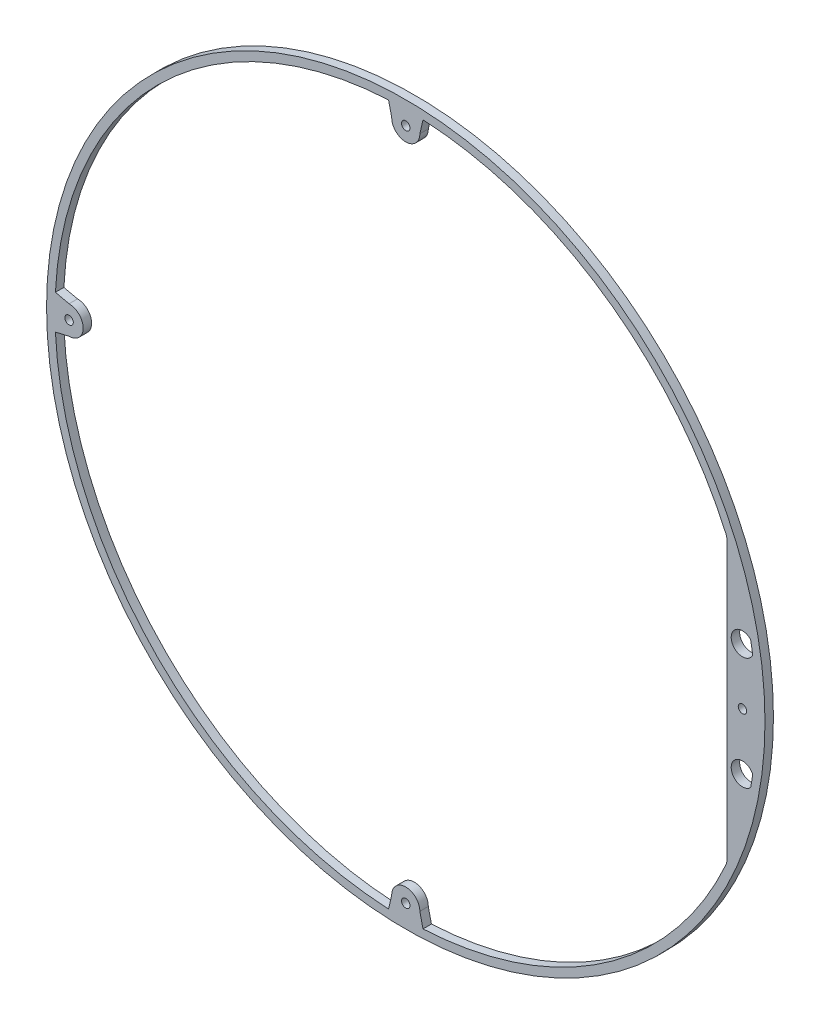
ISO-10303-21;
HEADER;
FILE_DESCRIPTION(('STEP AP214'),'2;1');
FILE_NAME('part.step','',(''),(''),'','','');
FILE_SCHEMA(('AUTOMOTIVE_DESIGN { 1 0 10303 214 1 1 1 1 }'));
ENDSEC;
DATA;
#1=APPLICATION_CONTEXT('core data for automotive mechanical design processes');
#2=APPLICATION_PROTOCOL_DEFINITION('international standard','automotive_design',2000,#1);
#3=PRODUCT_CONTEXT('',#1,'mechanical');
#4=PRODUCT('Part','Part','',(#3));
#5=PRODUCT_RELATED_PRODUCT_CATEGORY('part','',(#4));
#6=PRODUCT_DEFINITION_FORMATION('','',#4);
#7=PRODUCT_DEFINITION_CONTEXT('part definition',#1,'design');
#8=PRODUCT_DEFINITION('design','',#6,#7);
#9=PRODUCT_DEFINITION_SHAPE('','',#8);
#10=(LENGTH_UNIT() NAMED_UNIT(*) SI_UNIT(.MILLI.,.METRE.));
#11=(NAMED_UNIT(*) PLANE_ANGLE_UNIT() SI_UNIT($,.RADIAN.));
#12=(NAMED_UNIT(*) SI_UNIT($,.STERADIAN.) SOLID_ANGLE_UNIT());
#13=UNCERTAINTY_MEASURE_WITH_UNIT(LENGTH_MEASURE(1.E-05),#10,'distance_accuracy_value','');
#14=(GEOMETRIC_REPRESENTATION_CONTEXT(3) GLOBAL_UNCERTAINTY_ASSIGNED_CONTEXT((#13)) GLOBAL_UNIT_ASSIGNED_CONTEXT((#10,
#11,#12)) REPRESENTATION_CONTEXT('',''));
#15=CARTESIAN_POINT('',(0.,0.,0.));
#16=DIRECTION('',(0.,0.,1.));
#17=DIRECTION('',(1.,0.,0.));
#18=AXIS2_PLACEMENT_3D('',#15,#16,#17);
#19=CARTESIAN_POINT('',(0.,0.,3.));
#20=DIRECTION('',(0.,0.,-1.));
#21=DIRECTION('',(-1.,0.,0.));
#22=AXIS2_PLACEMENT_3D('',#19,#20,#21);
#23=CYLINDRICAL_SURFACE('',#22,124.525);
#24=CARTESIAN_POINT('',(0.,0.,0.));
#25=DIRECTION('',(0.,0.,1.));
#26=DIRECTION('',(1.,0.,0.));
#27=AXIS2_PLACEMENT_3D('',#24,#25,#26);
#28=CIRCLE('',#27,124.525);
#29=CARTESIAN_POINT('',(122.429089665661,-22.7506841355913,0.));
#30=VERTEX_POINT('',#29);
#31=CARTESIAN_POINT('',(123.166362086514,-18.3445598304702,0.));
#32=VERTEX_POINT('',#31);
#33=EDGE_CURVE('E355',#30,#32,#28,.T.);
#34=ORIENTED_EDGE('',*,*,#33,.F.);
#35=DIRECTION('',(0.,0.,1.));
#36=VECTOR('',#35,1.);
#37=CARTESIAN_POINT('',(122.429089665661,-22.7506841355913,-100.532032474409));
#38=LINE('',#37,#36);
#39=CARTESIAN_POINT('',(122.429089665661,-22.7506841355913,3.));
#40=VERTEX_POINT('',#39);
#41=EDGE_CURVE('E206',#30,#40,#38,.T.);
#42=ORIENTED_EDGE('',*,*,#41,.T.);
#43=CARTESIAN_POINT('',(0.,0.,3.));
#44=DIRECTION('',(0.,0.,1.));
#45=DIRECTION('',(1.,0.,0.));
#46=AXIS2_PLACEMENT_3D('',#43,#44,#45);
#47=CIRCLE('',#46,124.525);
#48=CARTESIAN_POINT('',(123.166362086514,-18.3445598304702,3.));
#49=VERTEX_POINT('',#48);
#50=EDGE_CURVE('E202',#40,#49,#47,.T.);
#51=ORIENTED_EDGE('',*,*,#50,.T.);
#52=DIRECTION('',(0.,0.,1.));
#53=VECTOR('',#52,1.);
#54=CARTESIAN_POINT('',(123.166362086514,-18.3445598304702,-100.532032474409));
#55=LINE('',#54,#53);
#56=EDGE_CURVE('E183',#32,#49,#55,.T.);
#57=ORIENTED_EDGE('',*,*,#56,.F.);
#58=EDGE_LOOP('',(#34,#42,#51,#57));
#59=FACE_BOUND('',#58,.T.);
#60=ADVANCED_FACE('F47',(#59),#23,.F.);
#61=CARTESIAN_POINT('',(6.11023731126729,-124.375,3.));
#62=VERTEX_POINT('',#61);
#63=CARTESIAN_POINT('',(113.607573635243,-50.9881833144974,3.));
#64=VERTEX_POINT('',#63);
#65=EDGE_CURVE('E208',#62,#64,#47,.T.);
#66=ORIENTED_EDGE('',*,*,#65,.T.);
#67=DIRECTION('',(0.,0.,-1.));
#68=VECTOR('',#67,1.);
#69=CARTESIAN_POINT('',(113.607573635243,-50.9881833144974,3.));
#70=LINE('',#69,#68);
#71=CARTESIAN_POINT('',(113.607573635243,-50.9881833144974,0.));
#72=VERTEX_POINT('',#71);
#73=EDGE_CURVE('E440',#64,#72,#70,.T.);
#74=ORIENTED_EDGE('',*,*,#73,.T.);
#75=CARTESIAN_POINT('',(6.11023731126729,-124.375,0.));
#76=VERTEX_POINT('',#75);
#77=EDGE_CURVE('E221',#76,#72,#28,.T.);
#78=ORIENTED_EDGE('',*,*,#77,.F.);
#79=DIRECTION('',(0.,0.,1.));
#80=VECTOR('',#79,1.);
#81=CARTESIAN_POINT('',(6.11023731126729,-124.375,-15.7905034751908));
#82=LINE('',#81,#80);
#83=EDGE_CURVE('E273',#76,#62,#82,.T.);
#84=ORIENTED_EDGE('',*,*,#83,.T.);
#85=EDGE_LOOP('',(#66,#74,#78,#84));
#86=FACE_BOUND('',#85,.T.);
#87=ADVANCED_FACE('F504',(#86),#23,.F.);
#88=CARTESIAN_POINT('',(123.166362086514,18.3445598304702,0.));
#89=VERTEX_POINT('',#88);
#90=CARTESIAN_POINT('',(122.429089665662,22.7506841355918,0.));
#91=VERTEX_POINT('',#90);
#92=EDGE_CURVE('E209',#89,#91,#28,.T.);
#93=ORIENTED_EDGE('',*,*,#92,.F.);
#94=DIRECTION('',(0.,0.,1.));
#95=VECTOR('',#94,1.);
#96=CARTESIAN_POINT('',(123.166362086514,18.3445598304702,-100.532032474409));
#97=LINE('',#96,#95);
#98=CARTESIAN_POINT('',(123.166362086514,18.3445598304702,3.));
#99=VERTEX_POINT('',#98);
#100=EDGE_CURVE('E195',#89,#99,#97,.T.);
#101=ORIENTED_EDGE('',*,*,#100,.T.);
#102=CARTESIAN_POINT('',(122.429089665661,22.7506841355914,3.));
#103=VERTEX_POINT('',#102);
#104=EDGE_CURVE('E217',#99,#103,#47,.T.);
#105=ORIENTED_EDGE('',*,*,#104,.T.);
#106=DIRECTION('',(0.,0.,1.));
#107=VECTOR('',#106,1.);
#108=CARTESIAN_POINT('',(122.429089665661,22.7506841355914,-100.532032474409));
#109=LINE('',#108,#107);
#110=EDGE_CURVE('E322',#91,#103,#109,.T.);
#111=ORIENTED_EDGE('',*,*,#110,.F.);
#112=EDGE_LOOP('',(#93,#101,#105,#111));
#113=FACE_BOUND('',#112,.T.);
#114=ADVANCED_FACE('F510',(#113),#23,.F.);
#115=CARTESIAN_POINT('',(-6.11023731126728,124.375,0.));
#116=VERTEX_POINT('',#115);
#117=CARTESIAN_POINT('',(-124.375,6.11023731126726,0.));
#118=VERTEX_POINT('',#117);
#119=EDGE_CURVE('E418',#116,#118,#28,.T.);
#120=ORIENTED_EDGE('',*,*,#119,.F.);
#121=DIRECTION('',(0.,0.,1.));
#122=VECTOR('',#121,1.);
#123=CARTESIAN_POINT('',(-6.11023731126728,124.375,-15.7905034751908));
#124=LINE('',#123,#122);
#125=CARTESIAN_POINT('',(-6.11023731126728,124.375,3.));
#126=VERTEX_POINT('',#125);
#127=EDGE_CURVE('E341',#116,#126,#124,.T.);
#128=ORIENTED_EDGE('',*,*,#127,.T.);
#129=CARTESIAN_POINT('',(-124.375,6.11023731126726,3.));
#130=VERTEX_POINT('',#129);
#131=EDGE_CURVE('E212',#126,#130,#47,.T.);
#132=ORIENTED_EDGE('',*,*,#131,.T.);
#133=DIRECTION('',(0.,0.,1.));
#134=VECTOR('',#133,1.);
#135=CARTESIAN_POINT('',(-124.375,6.11023731126726,-15.7905034751908));
#136=LINE('',#135,#134);
#137=EDGE_CURVE('E391',#118,#130,#136,.T.);
#138=ORIENTED_EDGE('',*,*,#137,.F.);
#139=EDGE_LOOP('',(#120,#128,#132,#138));
#140=FACE_BOUND('',#139,.T.);
#141=ADVANCED_FACE('F417',(#140),#23,.F.);
#142=CARTESIAN_POINT('',(-124.375,-6.1102373112673,0.));
#143=VERTEX_POINT('',#142);
#144=CARTESIAN_POINT('',(-6.11023731126726,-124.375,0.));
#145=VERTEX_POINT('',#144);
#146=EDGE_CURVE('E424',#143,#145,#28,.T.);
#147=ORIENTED_EDGE('',*,*,#146,.F.);
#148=DIRECTION('',(0.,0.,1.));
#149=VECTOR('',#148,1.);
#150=CARTESIAN_POINT('',(-124.375,-6.1102373112673,-15.7905034751908));
#151=LINE('',#150,#149);
#152=CARTESIAN_POINT('',(-124.375,-6.1102373112673,3.));
#153=VERTEX_POINT('',#152);
#154=EDGE_CURVE('E240',#143,#153,#151,.T.);
#155=ORIENTED_EDGE('',*,*,#154,.T.);
#156=CARTESIAN_POINT('',(-6.11023731126726,-124.375,3.));
#157=VERTEX_POINT('',#156);
#158=EDGE_CURVE('E216',#153,#157,#47,.T.);
#159=ORIENTED_EDGE('',*,*,#158,.T.);
#160=DIRECTION('',(0.,0.,1.));
#161=VECTOR('',#160,1.);
#162=CARTESIAN_POINT('',(-6.11023731126726,-124.375,-15.7905034751908));
#163=LINE('',#162,#161);
#164=EDGE_CURVE('E238',#145,#157,#163,.T.);
#165=ORIENTED_EDGE('',*,*,#164,.F.);
#166=EDGE_LOOP('',(#147,#155,#159,#165));
#167=FACE_BOUND('',#166,.T.);
#168=ADVANCED_FACE('F237',(#167),#23,.F.);
#169=CARTESIAN_POINT('',(113.607573635243,50.9881833144974,0.));
#170=VERTEX_POINT('',#169);
#171=CARTESIAN_POINT('',(6.11023731126729,124.375,0.));
#172=VERTEX_POINT('',#171);
#173=EDGE_CURVE('E219',#170,#172,#28,.T.);
#174=ORIENTED_EDGE('',*,*,#173,.F.);
#175=DIRECTION('',(0.,0.,-1.));
#176=VECTOR('',#175,1.);
#177=CARTESIAN_POINT('',(113.607573635243,50.9881833144974,3.));
#178=LINE('',#177,#176);
#179=CARTESIAN_POINT('',(113.607573635243,50.9881833144974,3.));
#180=VERTEX_POINT('',#179);
#181=EDGE_CURVE('E448',#170,#180,#178,.F.);
#182=ORIENTED_EDGE('',*,*,#181,.T.);
#183=CARTESIAN_POINT('',(6.11023731126728,124.375,3.));
#184=VERTEX_POINT('',#183);
#185=EDGE_CURVE('E211',#180,#184,#47,.T.);
#186=ORIENTED_EDGE('',*,*,#185,.T.);
#187=DIRECTION('',(0.,0.,1.));
#188=VECTOR('',#187,1.);
#189=CARTESIAN_POINT('',(6.11023731126728,124.375,-15.7905034751908));
#190=LINE('',#189,#188);
#191=EDGE_CURVE('E351',#172,#184,#190,.T.);
#192=ORIENTED_EDGE('',*,*,#191,.F.);
#193=EDGE_LOOP('',(#174,#182,#186,#192));
#194=FACE_BOUND('',#193,.T.);
#195=ADVANCED_FACE('F496',(#194),#23,.F.);
#196=CARTESIAN_POINT('',(0.,0.,3.));
#197=DIRECTION('',(0.,0.,1.));
#198=DIRECTION('',(1.,0.,0.));
#199=AXIS2_PLACEMENT_3D('',#196,#197,#198);
#200=PLANE('',#199);
#201=CARTESIAN_POINT('',(119.525,-20.,3.));
#202=DIRECTION('',(0.,0.,1.));
#203=DIRECTION('',(1.,0.,0.));
#204=AXIS2_PLACEMENT_3D('',#201,#202,#203);
#205=CIRCLE('',#204,3.99999999999999);
#206=EDGE_CURVE('E186',#49,#40,#205,.T.);
#207=ORIENTED_EDGE('',*,*,#206,.F.);
#208=ORIENTED_EDGE('',*,*,#50,.F.);
#209=EDGE_LOOP('',(#207,#208));
#210=FACE_BOUND('',#209,.T.);
#211=ORIENTED_EDGE('',*,*,#104,.F.);
#212=CARTESIAN_POINT('',(119.525,20.,3.));
#213=DIRECTION('',(0.,0.,1.));
#214=DIRECTION('',(1.,0.,0.));
#215=AXIS2_PLACEMENT_3D('',#212,#213,#214);
#216=CIRCLE('',#215,3.99999999999999);
#217=EDGE_CURVE('E204',#103,#99,#216,.T.);
#218=ORIENTED_EDGE('',*,*,#217,.F.);
#219=EDGE_LOOP('',(#211,#218));
#220=FACE_BOUND('',#219,.T.);
#221=ORIENTED_EDGE('',*,*,#185,.F.);
#222=CARTESIAN_POINT('',(109.0459364686,48.9408762149392,3.));
#223=DIRECTION('',(0.,0.,1.));
#224=DIRECTION('',(1.,0.,0.));
#225=AXIS2_PLACEMENT_3D('',#222,#223,#224);
#226=CIRCLE('',#225,5.);
#227=CARTESIAN_POINT('',(114.0459364686,48.9408762149392,3.));
#228=VERTEX_POINT('',#227);
#229=EDGE_CURVE('E56',#180,#228,#226,.F.);
#230=ORIENTED_EDGE('',*,*,#229,.T.);
#231=DIRECTION('',(0.,-1.,0.));
#232=VECTOR('',#231,1.);
#233=CARTESIAN_POINT('',(114.0459364686,0.,3.));
#234=LINE('',#233,#232);
#235=CARTESIAN_POINT('',(114.0459364686,-48.9408762149392,3.));
#236=VERTEX_POINT('',#235);
#237=EDGE_CURVE('E196',#228,#236,#234,.T.);
#238=ORIENTED_EDGE('',*,*,#237,.T.);
#239=CARTESIAN_POINT('',(109.0459364686,-48.9408762149392,3.));
#240=DIRECTION('',(0.,0.,1.));
#241=DIRECTION('',(1.,0.,0.));
#242=AXIS2_PLACEMENT_3D('',#239,#240,#241);
#243=CIRCLE('',#242,5.);
#244=EDGE_CURVE('E444',#236,#64,#243,.F.);
#245=ORIENTED_EDGE('',*,*,#244,.T.);
#246=ORIENTED_EDGE('',*,*,#65,.F.);
#247=DIRECTION('',(0.223142985847924,-0.974785724078309,0.));
#248=VECTOR('',#247,1.);
#249=CARTESIAN_POINT('',(-21.2476352210068,-4.86390049454815,3.));
#250=LINE('',#249,#248);
#251=CARTESIAN_POINT('',(5.00000000000002,-119.525,3.));
#252=VERTEX_POINT('',#251);
#253=EDGE_CURVE('E270',#252,#62,#250,.T.);
#254=ORIENTED_EDGE('',*,*,#253,.F.);
#255=CARTESIAN_POINT('',(0.,-119.525,3.));
#256=DIRECTION('',(0.,0.,1.));
#257=DIRECTION('',(1.,0.,0.));
#258=AXIS2_PLACEMENT_3D('',#255,#256,#257);
#259=CIRCLE('',#258,5.);
#260=CARTESIAN_POINT('',(-4.99999999999998,-119.525,3.));
#261=VERTEX_POINT('',#260);
#262=EDGE_CURVE('E254',#252,#261,#259,.T.);
#263=ORIENTED_EDGE('',*,*,#262,.T.);
#264=DIRECTION('',(-0.223142985847924,-0.974785724078309,0.));
#265=VECTOR('',#264,1.);
#266=CARTESIAN_POINT('',(21.2476352210068,-4.86390049454815,3.));
#267=LINE('',#266,#265);
#268=EDGE_CURVE('E251',#261,#157,#267,.T.);
#269=ORIENTED_EDGE('',*,*,#268,.T.);
#270=ORIENTED_EDGE('',*,*,#158,.F.);
#271=DIRECTION('',(-0.974785724078309,-0.223142985847924,0.));
#272=VECTOR('',#271,1.);
#273=CARTESIAN_POINT('',(-4.86390049454816,21.2476352210068,3.));
#274=LINE('',#273,#272);
#275=CARTESIAN_POINT('',(-119.525,-5.00000000000002,3.));
#276=VERTEX_POINT('',#275);
#277=EDGE_CURVE('E247',#276,#153,#274,.T.);
#278=ORIENTED_EDGE('',*,*,#277,.F.);
#279=CARTESIAN_POINT('',(-119.525,0.,3.));
#280=DIRECTION('',(0.,0.,1.));
#281=DIRECTION('',(1.,0.,0.));
#282=AXIS2_PLACEMENT_3D('',#279,#280,#281);
#283=CIRCLE('',#282,5.);
#284=CARTESIAN_POINT('',(-119.525,4.99999999999998,3.));
#285=VERTEX_POINT('',#284);
#286=EDGE_CURVE('E376',#276,#285,#283,.T.);
#287=ORIENTED_EDGE('',*,*,#286,.T.);
#288=DIRECTION('',(-0.974785724078309,0.223142985847923,0.));
#289=VECTOR('',#288,1.);
#290=CARTESIAN_POINT('',(-4.86390049454814,-21.2476352210068,3.));
#291=LINE('',#290,#289);
#292=EDGE_CURVE('E372',#285,#130,#291,.T.);
#293=ORIENTED_EDGE('',*,*,#292,.T.);
#294=ORIENTED_EDGE('',*,*,#131,.F.);
#295=DIRECTION('',(-0.223142985847924,0.974785724078309,0.));
#296=VECTOR('',#295,1.);
#297=CARTESIAN_POINT('',(21.2476352210068,4.86390049454815,3.));
#298=LINE('',#297,#296);
#299=CARTESIAN_POINT('',(-5.,119.525,3.));
#300=VERTEX_POINT('',#299);
#301=EDGE_CURVE('E338',#300,#126,#298,.T.);
#302=ORIENTED_EDGE('',*,*,#301,.F.);
#303=CARTESIAN_POINT('',(0.,119.525,3.));
#304=DIRECTION('',(0.,0.,1.));
#305=DIRECTION('',(1.,0.,0.));
#306=AXIS2_PLACEMENT_3D('',#303,#304,#305);
#307=CIRCLE('',#306,5.);
#308=CARTESIAN_POINT('',(5.,119.525,3.));
#309=VERTEX_POINT('',#308);
#310=EDGE_CURVE('E333',#300,#309,#307,.T.);
#311=ORIENTED_EDGE('',*,*,#310,.T.);
#312=DIRECTION('',(0.223142985847924,0.974785724078309,0.));
#313=VECTOR('',#312,1.);
#314=CARTESIAN_POINT('',(-21.2476352210068,4.86390049454815,3.));
#315=LINE('',#314,#313);
#316=EDGE_CURVE('E328',#309,#184,#315,.T.);
#317=ORIENTED_EDGE('',*,*,#316,.T.);
#318=EDGE_LOOP('',(#221,#230,#238,#245,#246,#254,#263,#269,#270,#278,#287,#293,#294,#302,#311,#317));
#319=FACE_BOUND('',#318,.T.);
#320=CARTESIAN_POINT('',(0.,0.,3.));
#321=DIRECTION('',(0.,0.,1.));
#322=DIRECTION('',(1.,0.,0.));
#323=AXIS2_PLACEMENT_3D('',#320,#321,#322);
#324=CIRCLE('',#323,127.525);
#325=CARTESIAN_POINT('',(127.525,0.,3.));
#326=VERTEX_POINT('',#325);
#327=EDGE_CURVE('E460',#326,#326,#324,.T.);
#328=ORIENTED_EDGE('',*,*,#327,.T.);
#329=EDGE_LOOP('',(#328));
#330=FACE_BOUND('',#329,.T.);
#331=CARTESIAN_POINT('',(119.525,0.,3.));
#332=DIRECTION('',(0.,0.,1.));
#333=DIRECTION('',(1.,0.,0.));
#334=AXIS2_PLACEMENT_3D('',#331,#332,#333);
#335=CIRCLE('',#334,1.5);
#336=CARTESIAN_POINT('',(121.025,0.,3.));
#337=VERTEX_POINT('',#336);
#338=EDGE_CURVE('E298',#337,#337,#335,.T.);
#339=ORIENTED_EDGE('',*,*,#338,.F.);
#340=EDGE_LOOP('',(#339));
#341=FACE_BOUND('',#340,.T.);
#342=CARTESIAN_POINT('',(0.,-119.525,3.));
#343=DIRECTION('',(0.,0.,1.));
#344=DIRECTION('',(1.,0.,0.));
#345=AXIS2_PLACEMENT_3D('',#342,#343,#344);
#346=CIRCLE('',#345,1.5);
#347=CARTESIAN_POINT('',(1.50000000000008,-119.525,3.));
#348=VERTEX_POINT('',#347);
#349=EDGE_CURVE('E275',#348,#348,#346,.T.);
#350=ORIENTED_EDGE('',*,*,#349,.F.);
#351=EDGE_LOOP('',(#350));
#352=FACE_BOUND('',#351,.T.);
#353=CARTESIAN_POINT('',(-119.525,0.,3.));
#354=DIRECTION('',(0.,0.,1.));
#355=DIRECTION('',(1.,0.,0.));
#356=AXIS2_PLACEMENT_3D('',#353,#354,#355);
#357=CIRCLE('',#356,1.5);
#358=CARTESIAN_POINT('',(-118.025,0.,3.));
#359=VERTEX_POINT('',#358);
#360=EDGE_CURVE('E383',#359,#359,#357,.T.);
#361=ORIENTED_EDGE('',*,*,#360,.F.);
#362=EDGE_LOOP('',(#361));
#363=FACE_BOUND('',#362,.T.);
#364=CARTESIAN_POINT('',(0.,119.525,3.));
#365=DIRECTION('',(0.,0.,1.));
#366=DIRECTION('',(1.,0.,0.));
#367=AXIS2_PLACEMENT_3D('',#364,#365,#366);
#368=CIRCLE('',#367,1.5);
#369=CARTESIAN_POINT('',(1.5,119.525,3.));
#370=VERTEX_POINT('',#369);
#371=EDGE_CURVE('E343',#370,#370,#368,.T.);
#372=ORIENTED_EDGE('',*,*,#371,.F.);
#373=EDGE_LOOP('',(#372));
#374=FACE_BOUND('',#373,.T.);
#375=ADVANCED_FACE('F200',(#210,#220,#319,#330,#341,#352,#363,#374),#200,.T.);
#376=CARTESIAN_POINT('',(0.,0.,0.));
#377=DIRECTION('',(0.,0.,1.));
#378=DIRECTION('',(1.,0.,0.));
#379=AXIS2_PLACEMENT_3D('',#376,#377,#378);
#380=PLANE('',#379);
#381=CARTESIAN_POINT('',(119.525,20.,0.));
#382=DIRECTION('',(0.,0.,1.));
#383=DIRECTION('',(1.,0.,0.));
#384=AXIS2_PLACEMENT_3D('',#381,#382,#383);
#385=CIRCLE('',#384,3.99999999999999);
#386=EDGE_CURVE('E311',#89,#91,#385,.F.);
#387=ORIENTED_EDGE('',*,*,#386,.F.);
#388=ORIENTED_EDGE('',*,*,#92,.T.);
#389=EDGE_LOOP('',(#387,#388));
#390=FACE_BOUND('',#389,.T.);
#391=ORIENTED_EDGE('',*,*,#77,.T.);
#392=CARTESIAN_POINT('',(109.0459364686,-48.9408762149392,0.));
#393=DIRECTION('',(0.,0.,1.));
#394=DIRECTION('',(1.,0.,0.));
#395=AXIS2_PLACEMENT_3D('',#392,#393,#394);
#396=CIRCLE('',#395,5.);
#397=CARTESIAN_POINT('',(114.0459364686,-48.9408762149392,0.));
#398=VERTEX_POINT('',#397);
#399=EDGE_CURVE('E433',#72,#398,#396,.T.);
#400=ORIENTED_EDGE('',*,*,#399,.T.);
#401=DIRECTION('',(0.,1.,0.));
#402=VECTOR('',#401,1.);
#403=CARTESIAN_POINT('',(114.0459364686,0.,0.));
#404=LINE('',#403,#402);
#405=CARTESIAN_POINT('',(114.0459364686,48.9408762149392,0.));
#406=VERTEX_POINT('',#405);
#407=EDGE_CURVE('E308',#398,#406,#404,.T.);
#408=ORIENTED_EDGE('',*,*,#407,.T.);
#409=CARTESIAN_POINT('',(109.0459364686,48.9408762149392,0.));
#410=DIRECTION('',(0.,0.,1.));
#411=DIRECTION('',(1.,0.,0.));
#412=AXIS2_PLACEMENT_3D('',#409,#410,#411);
#413=CIRCLE('',#412,5.);
#414=EDGE_CURVE('E11',#406,#170,#413,.T.);
#415=ORIENTED_EDGE('',*,*,#414,.T.);
#416=ORIENTED_EDGE('',*,*,#173,.T.);
#417=DIRECTION('',(-0.223142985847924,-0.974785724078309,0.));
#418=VECTOR('',#417,1.);
#419=CARTESIAN_POINT('',(-21.2476352210068,4.86390049454815,0.));
#420=LINE('',#419,#418);
#421=CARTESIAN_POINT('',(5.,119.525,0.));
#422=VERTEX_POINT('',#421);
#423=EDGE_CURVE('E332',#172,#422,#420,.T.);
#424=ORIENTED_EDGE('',*,*,#423,.T.);
#425=CARTESIAN_POINT('',(0.,119.525,0.));
#426=DIRECTION('',(0.,0.,1.));
#427=DIRECTION('',(1.,0.,0.));
#428=AXIS2_PLACEMENT_3D('',#425,#426,#427);
#429=CIRCLE('',#428,5.);
#430=CARTESIAN_POINT('',(-5.,119.525,0.));
#431=VERTEX_POINT('',#430);
#432=EDGE_CURVE('E352',#422,#431,#429,.F.);
#433=ORIENTED_EDGE('',*,*,#432,.T.);
#434=DIRECTION('',(0.223142985847924,-0.974785724078309,0.));
#435=VECTOR('',#434,1.);
#436=CARTESIAN_POINT('',(21.2476352210068,4.86390049454815,0.));
#437=LINE('',#436,#435);
#438=EDGE_CURVE('E365',#116,#431,#437,.T.);
#439=ORIENTED_EDGE('',*,*,#438,.F.);
#440=ORIENTED_EDGE('',*,*,#119,.T.);
#441=DIRECTION('',(0.974785724078309,-0.223142985847924,0.));
#442=VECTOR('',#441,1.);
#443=CARTESIAN_POINT('',(-4.86390049454814,-21.2476352210068,0.));
#444=LINE('',#443,#442);
#445=CARTESIAN_POINT('',(-119.525,4.99999999999998,0.));
#446=VERTEX_POINT('',#445);
#447=EDGE_CURVE('E267',#118,#446,#444,.T.);
#448=ORIENTED_EDGE('',*,*,#447,.T.);
#449=CARTESIAN_POINT('',(-119.525,0.,0.));
#450=DIRECTION('',(0.,0.,1.));
#451=DIRECTION('',(1.,0.,0.));
#452=AXIS2_PLACEMENT_3D('',#449,#450,#451);
#453=CIRCLE('',#452,5.);
#454=CARTESIAN_POINT('',(-119.525,-5.00000000000002,0.));
#455=VERTEX_POINT('',#454);
#456=EDGE_CURVE('E369',#446,#455,#453,.F.);
#457=ORIENTED_EDGE('',*,*,#456,.T.);
#458=DIRECTION('',(0.974785724078309,0.223142985847924,0.));
#459=VECTOR('',#458,1.);
#460=CARTESIAN_POINT('',(-4.86390049454816,21.2476352210068,0.));
#461=LINE('',#460,#459);
#462=EDGE_CURVE('E285',#143,#455,#461,.T.);
#463=ORIENTED_EDGE('',*,*,#462,.F.);
#464=ORIENTED_EDGE('',*,*,#146,.T.);
#465=DIRECTION('',(0.223142985847924,0.974785724078309,0.));
#466=VECTOR('',#465,1.);
#467=CARTESIAN_POINT('',(21.2476352210068,-4.86390049454815,0.));
#468=LINE('',#467,#466);
#469=CARTESIAN_POINT('',(-4.99999999999998,-119.525,0.));
#470=VERTEX_POINT('',#469);
#471=EDGE_CURVE('E258',#145,#470,#468,.T.);
#472=ORIENTED_EDGE('',*,*,#471,.T.);
#473=CARTESIAN_POINT('',(0.,-119.525,0.));
#474=DIRECTION('',(0.,0.,1.));
#475=DIRECTION('',(1.,0.,0.));
#476=AXIS2_PLACEMENT_3D('',#473,#474,#475);
#477=CIRCLE('',#476,5.);
#478=CARTESIAN_POINT('',(5.00000000000002,-119.525,0.));
#479=VERTEX_POINT('',#478);
#480=EDGE_CURVE('E262',#470,#479,#477,.F.);
#481=ORIENTED_EDGE('',*,*,#480,.T.);
#482=DIRECTION('',(-0.223142985847924,0.974785724078309,0.));
#483=VECTOR('',#482,1.);
#484=CARTESIAN_POINT('',(-21.2476352210068,-4.86390049454815,0.));
#485=LINE('',#484,#483);
#486=EDGE_CURVE('E295',#76,#479,#485,.T.);
#487=ORIENTED_EDGE('',*,*,#486,.F.);
#488=EDGE_LOOP('',(#391,#400,#408,#415,#416,#424,#433,#439,#440,#448,#457,#463,#464,#472,#481,#487));
#489=FACE_BOUND('',#488,.T.);
#490=CARTESIAN_POINT('',(119.525,-20.,0.));
#491=DIRECTION('',(0.,0.,1.));
#492=DIRECTION('',(1.,0.,0.));
#493=AXIS2_PLACEMENT_3D('',#490,#491,#492);
#494=CIRCLE('',#493,3.99999999999999);
#495=EDGE_CURVE('E189',#30,#32,#494,.F.);
#496=ORIENTED_EDGE('',*,*,#495,.F.);
#497=ORIENTED_EDGE('',*,*,#33,.T.);
#498=EDGE_LOOP('',(#496,#497));
#499=FACE_BOUND('',#498,.T.);
#500=CARTESIAN_POINT('',(0.,0.,0.));
#501=DIRECTION('',(0.,0.,1.));
#502=DIRECTION('',(1.,0.,0.));
#503=AXIS2_PLACEMENT_3D('',#500,#501,#502);
#504=CIRCLE('',#503,127.525);
#505=CARTESIAN_POINT('',(127.525,0.,0.));
#506=VERTEX_POINT('',#505);
#507=EDGE_CURVE('E461',#506,#506,#504,.T.);
#508=ORIENTED_EDGE('',*,*,#507,.F.);
#509=EDGE_LOOP('',(#508));
#510=FACE_BOUND('',#509,.T.);
#511=CARTESIAN_POINT('',(119.525,0.,0.));
#512=DIRECTION('',(0.,0.,1.));
#513=DIRECTION('',(1.,0.,0.));
#514=AXIS2_PLACEMENT_3D('',#511,#512,#513);
#515=CIRCLE('',#514,1.5);
#516=CARTESIAN_POINT('',(121.025,0.,0.));
#517=VERTEX_POINT('',#516);
#518=EDGE_CURVE('E302',#517,#517,#515,.F.);
#519=ORIENTED_EDGE('',*,*,#518,.F.);
#520=EDGE_LOOP('',(#519));
#521=FACE_BOUND('',#520,.T.);
#522=CARTESIAN_POINT('',(0.,-119.525,0.));
#523=DIRECTION('',(0.,0.,1.));
#524=DIRECTION('',(1.,0.,0.));
#525=AXIS2_PLACEMENT_3D('',#522,#523,#524);
#526=CIRCLE('',#525,1.5);
#527=CARTESIAN_POINT('',(1.50000000000008,-119.525,0.));
#528=VERTEX_POINT('',#527);
#529=EDGE_CURVE('E279',#528,#528,#526,.F.);
#530=ORIENTED_EDGE('',*,*,#529,.F.);
#531=EDGE_LOOP('',(#530));
#532=FACE_BOUND('',#531,.T.);
#533=CARTESIAN_POINT('',(-119.525,0.,0.));
#534=DIRECTION('',(0.,0.,1.));
#535=DIRECTION('',(1.,0.,0.));
#536=AXIS2_PLACEMENT_3D('',#533,#534,#535);
#537=CIRCLE('',#536,1.5);
#538=CARTESIAN_POINT('',(-118.025,0.,0.));
#539=VERTEX_POINT('',#538);
#540=EDGE_CURVE('E387',#539,#539,#537,.F.);
#541=ORIENTED_EDGE('',*,*,#540,.F.);
#542=EDGE_LOOP('',(#541));
#543=FACE_BOUND('',#542,.T.);
#544=CARTESIAN_POINT('',(0.,119.525,0.));
#545=DIRECTION('',(0.,0.,1.));
#546=DIRECTION('',(1.,0.,0.));
#547=AXIS2_PLACEMENT_3D('',#544,#545,#546);
#548=CIRCLE('',#547,1.5);
#549=CARTESIAN_POINT('',(1.5,119.525,0.));
#550=VERTEX_POINT('',#549);
#551=EDGE_CURVE('E347',#550,#550,#548,.F.);
#552=ORIENTED_EDGE('',*,*,#551,.F.);
#553=EDGE_LOOP('',(#552));
#554=FACE_BOUND('',#553,.T.);
#555=ADVANCED_FACE('F421',(#390,#489,#499,#510,#521,#532,#543,#554),#380,.F.);
#556=CARTESIAN_POINT('',(0.,0.,3.));
#557=DIRECTION('',(0.,0.,-1.));
#558=DIRECTION('',(-1.,0.,0.));
#559=AXIS2_PLACEMENT_3D('',#556,#557,#558);
#560=CYLINDRICAL_SURFACE('',#559,127.525);
#561=ORIENTED_EDGE('',*,*,#327,.F.);
#562=EDGE_LOOP('',(#561));
#563=FACE_BOUND('',#562,.T.);
#564=ORIENTED_EDGE('',*,*,#507,.T.);
#565=EDGE_LOOP('',(#564));
#566=FACE_BOUND('',#565,.T.);
#567=ADVANCED_FACE('F469',(#563,#566),#560,.T.);
#568=CARTESIAN_POINT('',(119.525,0.,-15.7905034751908));
#569=DIRECTION('',(0.,0.,1.));
#570=DIRECTION('',(1.,0.,0.));
#571=AXIS2_PLACEMENT_3D('',#568,#569,#570);
#572=CYLINDRICAL_SURFACE('',#571,1.5);
#573=ORIENTED_EDGE('',*,*,#518,.T.);
#574=EDGE_LOOP('',(#573));
#575=FACE_BOUND('',#574,.T.);
#576=ORIENTED_EDGE('',*,*,#338,.T.);
#577=EDGE_LOOP('',(#576));
#578=FACE_BOUND('',#577,.T.);
#579=ADVANCED_FACE('F472',(#575,#578),#572,.F.);
#580=CARTESIAN_POINT('',(-21.2476352210068,-4.86390049454815,-15.7905034751908));
#581=DIRECTION('',(-0.974785724078309,-0.223142985847924,0.));
#582=DIRECTION('',(0.223142985847924,-0.974785724078309,0.));
#583=AXIS2_PLACEMENT_3D('',#580,#581,#582);
#584=PLANE('',#583);
#585=ORIENTED_EDGE('',*,*,#83,.F.);
#586=ORIENTED_EDGE('',*,*,#486,.T.);
#587=DIRECTION('',(0.,0.,1.));
#588=VECTOR('',#587,1.);
#589=CARTESIAN_POINT('',(5.00000000000002,-119.525,-15.7905034751908));
#590=LINE('',#589,#588);
#591=EDGE_CURVE('E274',#479,#252,#590,.T.);
#592=ORIENTED_EDGE('',*,*,#591,.T.);
#593=ORIENTED_EDGE('',*,*,#253,.T.);
#594=EDGE_LOOP('',(#585,#586,#592,#593));
#595=FACE_BOUND('',#594,.T.);
#596=ADVANCED_FACE('F570',(#595),#584,.F.);
#597=CARTESIAN_POINT('',(21.2476352210068,-4.86390049454815,-15.7905034751908));
#598=DIRECTION('',(-0.974785724078309,0.223142985847924,0.));
#599=DIRECTION('',(-0.223142985847924,-0.974785724078309,0.));
#600=AXIS2_PLACEMENT_3D('',#597,#598,#599);
#601=PLANE('',#600);
#602=ORIENTED_EDGE('',*,*,#471,.F.);
#603=ORIENTED_EDGE('',*,*,#164,.T.);
#604=ORIENTED_EDGE('',*,*,#268,.F.);
#605=DIRECTION('',(0.,0.,1.));
#606=VECTOR('',#605,1.);
#607=CARTESIAN_POINT('',(-4.99999999999998,-119.525,-15.7905034751908));
#608=LINE('',#607,#606);
#609=EDGE_CURVE('E264',#470,#261,#608,.T.);
#610=ORIENTED_EDGE('',*,*,#609,.F.);
#611=EDGE_LOOP('',(#602,#603,#604,#610));
#612=FACE_BOUND('',#611,.T.);
#613=ADVANCED_FACE('F563',(#612),#601,.T.);
#614=CARTESIAN_POINT('',(0.,-119.525,-15.7905034751908));
#615=DIRECTION('',(0.,0.,1.));
#616=DIRECTION('',(1.,0.,0.));
#617=AXIS2_PLACEMENT_3D('',#614,#615,#616);
#618=CYLINDRICAL_SURFACE('',#617,1.5);
#619=ORIENTED_EDGE('',*,*,#529,.T.);
#620=EDGE_LOOP('',(#619));
#621=FACE_BOUND('',#620,.T.);
#622=ORIENTED_EDGE('',*,*,#349,.T.);
#623=EDGE_LOOP('',(#622));
#624=FACE_BOUND('',#623,.T.);
#625=ADVANCED_FACE('F560',(#621,#624),#618,.F.);
#626=CARTESIAN_POINT('',(0.,-119.525,-15.7905034751908));
#627=DIRECTION('',(0.,0.,1.));
#628=DIRECTION('',(1.,0.,0.));
#629=AXIS2_PLACEMENT_3D('',#626,#627,#628);
#630=CYLINDRICAL_SURFACE('',#629,5.);
#631=ORIENTED_EDGE('',*,*,#480,.F.);
#632=ORIENTED_EDGE('',*,*,#609,.T.);
#633=ORIENTED_EDGE('',*,*,#262,.F.);
#634=ORIENTED_EDGE('',*,*,#591,.F.);
#635=EDGE_LOOP('',(#631,#632,#633,#634));
#636=FACE_BOUND('',#635,.T.);
#637=ADVANCED_FACE('F559',(#636),#630,.T.);
#638=CARTESIAN_POINT('',(-4.86390049454816,21.2476352210068,-15.7905034751908));
#639=DIRECTION('',(-0.223142985847924,0.974785724078309,0.));
#640=DIRECTION('',(-0.974785724078309,-0.223142985847924,0.));
#641=AXIS2_PLACEMENT_3D('',#638,#639,#640);
#642=PLANE('',#641);
#643=ORIENTED_EDGE('',*,*,#154,.F.);
#644=ORIENTED_EDGE('',*,*,#462,.T.);
#645=DIRECTION('',(0.,0.,1.));
#646=VECTOR('',#645,1.);
#647=CARTESIAN_POINT('',(-119.525,-5.00000000000002,-15.7905034751908));
#648=LINE('',#647,#646);
#649=EDGE_CURVE('E382',#455,#276,#648,.T.);
#650=ORIENTED_EDGE('',*,*,#649,.T.);
#651=ORIENTED_EDGE('',*,*,#277,.T.);
#652=EDGE_LOOP('',(#643,#644,#650,#651));
#653=FACE_BOUND('',#652,.T.);
#654=ADVANCED_FACE('F406',(#653),#642,.F.);
#655=CARTESIAN_POINT('',(-4.86390049454814,-21.2476352210068,-15.7905034751908));
#656=DIRECTION('',(0.223142985847923,0.974785724078309,0.));
#657=DIRECTION('',(-0.974785724078309,0.223142985847924,0.));
#658=AXIS2_PLACEMENT_3D('',#655,#656,#657);
#659=PLANE('',#658);
#660=ORIENTED_EDGE('',*,*,#447,.F.);
#661=ORIENTED_EDGE('',*,*,#137,.T.);
#662=ORIENTED_EDGE('',*,*,#292,.F.);
#663=DIRECTION('',(0.,0.,1.));
#664=VECTOR('',#663,1.);
#665=CARTESIAN_POINT('',(-119.525,4.99999999999998,-15.7905034751908));
#666=LINE('',#665,#664);
#667=EDGE_CURVE('E379',#446,#285,#666,.T.);
#668=ORIENTED_EDGE('',*,*,#667,.F.);
#669=EDGE_LOOP('',(#660,#661,#662,#668));
#670=FACE_BOUND('',#669,.T.);
#671=ADVANCED_FACE('F414',(#670),#659,.T.);
#672=CARTESIAN_POINT('',(-119.525,0.,-15.7905034751908));
#673=DIRECTION('',(0.,0.,1.));
#674=DIRECTION('',(1.,0.,0.));
#675=AXIS2_PLACEMENT_3D('',#672,#673,#674);
#676=CYLINDRICAL_SURFACE('',#675,1.5);
#677=ORIENTED_EDGE('',*,*,#540,.T.);
#678=EDGE_LOOP('',(#677));
#679=FACE_BOUND('',#678,.T.);
#680=ORIENTED_EDGE('',*,*,#360,.T.);
#681=EDGE_LOOP('',(#680));
#682=FACE_BOUND('',#681,.T.);
#683=ADVANCED_FACE('F549',(#679,#682),#676,.F.);
#684=CARTESIAN_POINT('',(-119.525,0.,-15.7905034751908));
#685=DIRECTION('',(0.,0.,1.));
#686=DIRECTION('',(1.,0.,0.));
#687=AXIS2_PLACEMENT_3D('',#684,#685,#686);
#688=CYLINDRICAL_SURFACE('',#687,5.);
#689=ORIENTED_EDGE('',*,*,#456,.F.);
#690=ORIENTED_EDGE('',*,*,#667,.T.);
#691=ORIENTED_EDGE('',*,*,#286,.F.);
#692=ORIENTED_EDGE('',*,*,#649,.F.);
#693=EDGE_LOOP('',(#689,#690,#691,#692));
#694=FACE_BOUND('',#693,.T.);
#695=ADVANCED_FACE('F409',(#694),#688,.T.);
#696=CARTESIAN_POINT('',(21.2476352210068,4.86390049454815,-15.7905034751908));
#697=DIRECTION('',(0.974785724078309,0.223142985847924,0.));
#698=DIRECTION('',(-0.223142985847924,0.974785724078309,0.));
#699=AXIS2_PLACEMENT_3D('',#696,#697,#698);
#700=PLANE('',#699);
#701=ORIENTED_EDGE('',*,*,#127,.F.);
#702=ORIENTED_EDGE('',*,*,#438,.T.);
#703=DIRECTION('',(0.,0.,1.));
#704=VECTOR('',#703,1.);
#705=CARTESIAN_POINT('',(-5.,119.525,-15.7905034751908));
#706=LINE('',#705,#704);
#707=EDGE_CURVE('E342',#431,#300,#706,.T.);
#708=ORIENTED_EDGE('',*,*,#707,.T.);
#709=ORIENTED_EDGE('',*,*,#301,.T.);
#710=EDGE_LOOP('',(#701,#702,#708,#709));
#711=FACE_BOUND('',#710,.T.);
#712=ADVANCED_FACE('F544',(#711),#700,.F.);
#713=CARTESIAN_POINT('',(-21.2476352210068,4.86390049454815,-15.7905034751908));
#714=DIRECTION('',(0.974785724078309,-0.223142985847924,0.));
#715=DIRECTION('',(0.223142985847924,0.974785724078309,0.));
#716=AXIS2_PLACEMENT_3D('',#713,#714,#715);
#717=PLANE('',#716);
#718=ORIENTED_EDGE('',*,*,#423,.F.);
#719=ORIENTED_EDGE('',*,*,#191,.T.);
#720=ORIENTED_EDGE('',*,*,#316,.F.);
#721=DIRECTION('',(0.,0.,1.));
#722=VECTOR('',#721,1.);
#723=CARTESIAN_POINT('',(5.,119.525,-15.7905034751908));
#724=LINE('',#723,#722);
#725=EDGE_CURVE('E337',#422,#309,#724,.T.);
#726=ORIENTED_EDGE('',*,*,#725,.F.);
#727=EDGE_LOOP('',(#718,#719,#720,#726));
#728=FACE_BOUND('',#727,.T.);
#729=ADVANCED_FACE('F491',(#728),#717,.T.);
#730=CARTESIAN_POINT('',(0.,119.525,-15.7905034751908));
#731=DIRECTION('',(0.,0.,1.));
#732=DIRECTION('',(1.,0.,0.));
#733=AXIS2_PLACEMENT_3D('',#730,#731,#732);
#734=CYLINDRICAL_SURFACE('',#733,1.5);
#735=ORIENTED_EDGE('',*,*,#551,.T.);
#736=EDGE_LOOP('',(#735));
#737=FACE_BOUND('',#736,.T.);
#738=ORIENTED_EDGE('',*,*,#371,.T.);
#739=EDGE_LOOP('',(#738));
#740=FACE_BOUND('',#739,.T.);
#741=ADVANCED_FACE('F487',(#737,#740),#734,.F.);
#742=CARTESIAN_POINT('',(0.,119.525,-15.7905034751908));
#743=DIRECTION('',(0.,0.,1.));
#744=DIRECTION('',(1.,0.,0.));
#745=AXIS2_PLACEMENT_3D('',#742,#743,#744);
#746=CYLINDRICAL_SURFACE('',#745,5.);
#747=ORIENTED_EDGE('',*,*,#432,.F.);
#748=ORIENTED_EDGE('',*,*,#725,.T.);
#749=ORIENTED_EDGE('',*,*,#310,.F.);
#750=ORIENTED_EDGE('',*,*,#707,.F.);
#751=EDGE_LOOP('',(#747,#748,#749,#750));
#752=FACE_BOUND('',#751,.T.);
#753=ADVANCED_FACE('F490',(#752),#746,.T.);
#754=CARTESIAN_POINT('',(119.525,20.,-100.532032474409));
#755=DIRECTION('',(0.,0.,1.));
#756=DIRECTION('',(1.,0.,0.));
#757=AXIS2_PLACEMENT_3D('',#754,#755,#756);
#758=CYLINDRICAL_SURFACE('',#757,3.99999999999999);
#759=ORIENTED_EDGE('',*,*,#100,.F.);
#760=ORIENTED_EDGE('',*,*,#386,.T.);
#761=ORIENTED_EDGE('',*,*,#110,.T.);
#762=ORIENTED_EDGE('',*,*,#217,.T.);
#763=EDGE_LOOP('',(#759,#760,#761,#762));
#764=FACE_BOUND('',#763,.T.);
#765=ADVANCED_FACE('F527',(#764),#758,.F.);
#766=CARTESIAN_POINT('',(114.0459364686,0.,-100.532032474409));
#767=DIRECTION('',(-1.,0.,0.));
#768=DIRECTION('',(0.,0.,1.));
#769=AXIS2_PLACEMENT_3D('',#766,#767,#768);
#770=PLANE('',#769);
#771=ORIENTED_EDGE('',*,*,#407,.F.);
#772=DIRECTION('',(0.,0.,1.));
#773=VECTOR('',#772,1.);
#774=CARTESIAN_POINT('',(114.0459364686,-48.9408762149392,3.));
#775=LINE('',#774,#773);
#776=EDGE_CURVE('E442',#398,#236,#775,.T.);
#777=ORIENTED_EDGE('',*,*,#776,.T.);
#778=ORIENTED_EDGE('',*,*,#237,.F.);
#779=DIRECTION('',(0.,0.,1.));
#780=VECTOR('',#779,1.);
#781=CARTESIAN_POINT('',(114.0459364686,48.9408762149392,0.));
#782=LINE('',#781,#780);
#783=EDGE_CURVE('E457',#228,#406,#782,.F.);
#784=ORIENTED_EDGE('',*,*,#783,.T.);
#785=EDGE_LOOP('',(#771,#777,#778,#784));
#786=FACE_BOUND('',#785,.T.);
#787=ADVANCED_FACE('F530',(#786),#770,.T.);
#788=CARTESIAN_POINT('',(119.525,-20.,-100.532032474409));
#789=DIRECTION('',(0.,0.,1.));
#790=DIRECTION('',(1.,0.,0.));
#791=AXIS2_PLACEMENT_3D('',#788,#789,#790);
#792=CYLINDRICAL_SURFACE('',#791,3.99999999999999);
#793=ORIENTED_EDGE('',*,*,#41,.F.);
#794=ORIENTED_EDGE('',*,*,#495,.T.);
#795=ORIENTED_EDGE('',*,*,#56,.T.);
#796=ORIENTED_EDGE('',*,*,#206,.T.);
#797=EDGE_LOOP('',(#793,#794,#795,#796));
#798=FACE_BOUND('',#797,.T.);
#799=ADVANCED_FACE('F185',(#798),#792,.F.);
#800=CARTESIAN_POINT('',(109.0459364686,-48.9408762149392,3.));
#801=DIRECTION('',(0.,0.,-1.));
#802=DIRECTION('',(-1.,0.,0.));
#803=AXIS2_PLACEMENT_3D('',#800,#801,#802);
#804=CYLINDRICAL_SURFACE('',#803,5.);
#805=ORIENTED_EDGE('',*,*,#399,.F.);
#806=ORIENTED_EDGE('',*,*,#73,.F.);
#807=ORIENTED_EDGE('',*,*,#244,.F.);
#808=ORIENTED_EDGE('',*,*,#776,.F.);
#809=EDGE_LOOP('',(#805,#806,#807,#808));
#810=FACE_BOUND('',#809,.T.);
#811=ADVANCED_FACE('F439',(#810),#804,.F.);
#812=CARTESIAN_POINT('',(109.0459364686,48.9408762149392,3.));
#813=DIRECTION('',(0.,0.,-1.));
#814=DIRECTION('',(-1.,0.,0.));
#815=AXIS2_PLACEMENT_3D('',#812,#813,#814);
#816=CYLINDRICAL_SURFACE('',#815,5.);
#817=ORIENTED_EDGE('',*,*,#414,.F.);
#818=ORIENTED_EDGE('',*,*,#783,.F.);
#819=ORIENTED_EDGE('',*,*,#229,.F.);
#820=ORIENTED_EDGE('',*,*,#181,.F.);
#821=EDGE_LOOP('',(#817,#818,#819,#820));
#822=FACE_BOUND('',#821,.T.);
#823=ADVANCED_FACE('F49',(#822),#816,.F.);
#824=CLOSED_SHELL('',(#60,#87,#114,#141,#168,#195,#375,#555,#567,#579,#596,#613,#625,#637,#654,
#671,#683,#695,#712,#729,#741,#753,#765,#787,#799,#811,#823));
#825=MANIFOLD_SOLID_BREP('B2',#824);
#826=ADVANCED_BREP_SHAPE_REPRESENTATION('',(#18,#825),#14);
#827=SHAPE_DEFINITION_REPRESENTATION(#9,#826);
ENDSEC;
END-ISO-10303-21;
